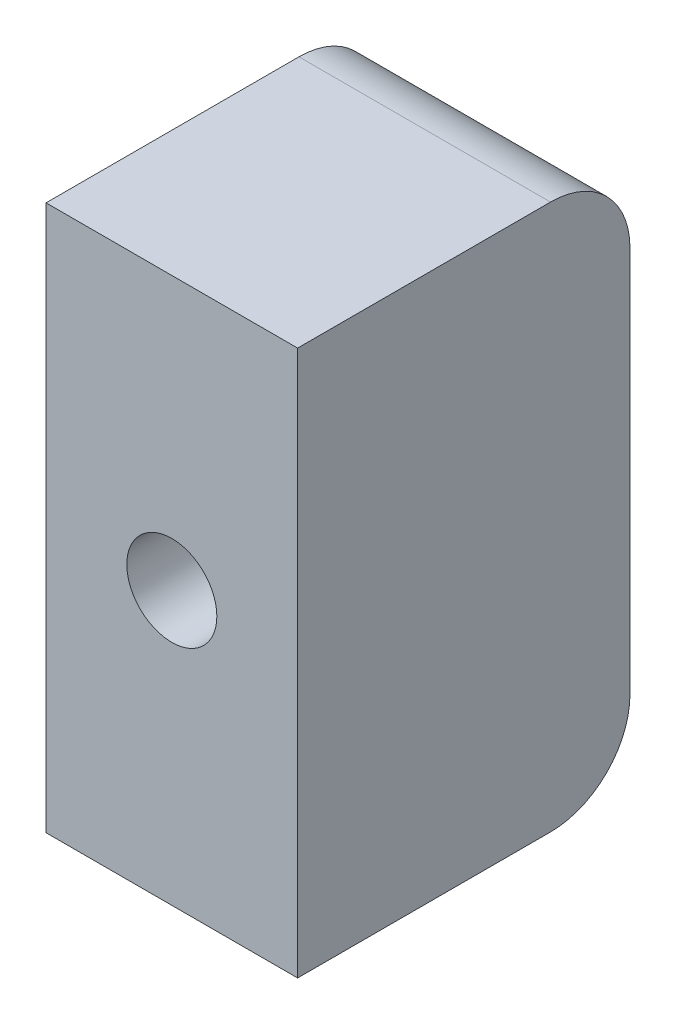
ISO-10303-21;
HEADER;
FILE_DESCRIPTION(('STEP AP214'),'2;1');
FILE_NAME('part.step','',(''),(''),'','','');
FILE_SCHEMA(('AUTOMOTIVE_DESIGN { 1 0 10303 214 1 1 1 1 }'));
ENDSEC;
DATA;
#1=APPLICATION_CONTEXT('core data for automotive mechanical design processes');
#2=APPLICATION_PROTOCOL_DEFINITION('international standard','automotive_design',2000,#1);
#3=PRODUCT_CONTEXT('',#1,'mechanical');
#4=PRODUCT('Part','Part','',(#3));
#5=PRODUCT_RELATED_PRODUCT_CATEGORY('part','',(#4));
#6=PRODUCT_DEFINITION_FORMATION('','',#4);
#7=PRODUCT_DEFINITION_CONTEXT('part definition',#1,'design');
#8=PRODUCT_DEFINITION('design','',#6,#7);
#9=PRODUCT_DEFINITION_SHAPE('','',#8);
#10=(LENGTH_UNIT() NAMED_UNIT(*) SI_UNIT(.MILLI.,.METRE.));
#11=(NAMED_UNIT(*) PLANE_ANGLE_UNIT() SI_UNIT($,.RADIAN.));
#12=(NAMED_UNIT(*) SI_UNIT($,.STERADIAN.) SOLID_ANGLE_UNIT());
#13=UNCERTAINTY_MEASURE_WITH_UNIT(LENGTH_MEASURE(1.E-05),#10,'distance_accuracy_value','');
#14=(GEOMETRIC_REPRESENTATION_CONTEXT(3) GLOBAL_UNCERTAINTY_ASSIGNED_CONTEXT((#13)) GLOBAL_UNIT_ASSIGNED_CONTEXT((#10,
#11,#12)) REPRESENTATION_CONTEXT('',''));
#15=CARTESIAN_POINT('',(0.,0.,0.));
#16=DIRECTION('',(0.,0.,1.));
#17=DIRECTION('',(1.,0.,0.));
#18=AXIS2_PLACEMENT_3D('',#15,#16,#17);
#19=CARTESIAN_POINT('',(-67.2436524322106,15.4000000000002,6.00000000000023));
#20=DIRECTION('',(1.,0.,0.));
#21=DIRECTION('',(0.,0.,-1.));
#22=AXIS2_PLACEMENT_3D('',#19,#20,#21);
#23=CYLINDRICAL_SURFACE('',#22,6.);
#24=CARTESIAN_POINT('',(-18.9999999999994,15.4000000000002,6.00000000000001));
#25=DIRECTION('',(1.,0.,0.));
#26=DIRECTION('',(0.,0.,-1.));
#27=AXIS2_PLACEMENT_3D('',#24,#25,#26);
#28=CIRCLE('',#27,6.);
#29=CARTESIAN_POINT('',(-18.9999999999994,15.4000000000002,0.));
#30=VERTEX_POINT('',#29);
#31=CARTESIAN_POINT('',(-18.9999999999994,9.40000000000017,6.00000000000034));
#32=VERTEX_POINT('',#31);
#33=EDGE_CURVE('E49',#30,#32,#28,.F.);
#34=ORIENTED_EDGE('',*,*,#33,.F.);
#35=DIRECTION('',(1.,0.,0.));
#36=VECTOR('',#35,1.);
#37=CARTESIAN_POINT('',(-67.2436524322106,15.4000000000001,2.22044604925031E-13));
#38=LINE('',#37,#36);
#39=CARTESIAN_POINT('',(0.,15.4000000000001,0.));
#40=VERTEX_POINT('',#39);
#41=EDGE_CURVE('E88',#30,#40,#38,.T.);
#42=ORIENTED_EDGE('',*,*,#41,.T.);
#43=CARTESIAN_POINT('',(0.,15.4000000000001,6.00000000000001));
#44=DIRECTION('',(1.,0.,0.));
#45=DIRECTION('',(0.,0.,-1.));
#46=AXIS2_PLACEMENT_3D('',#43,#44,#45);
#47=CIRCLE('',#46,6.);
#48=CARTESIAN_POINT('',(0.,9.40000000000014,6.00000000000034));
#49=VERTEX_POINT('',#48);
#50=EDGE_CURVE('E92',#49,#40,#47,.T.);
#51=ORIENTED_EDGE('',*,*,#50,.F.);
#52=DIRECTION('',(1.,0.,0.));
#53=VECTOR('',#52,1.);
#54=CARTESIAN_POINT('',(-67.2436524322106,9.40000000000016,6.0000000000005));
#55=LINE('',#54,#53);
#56=EDGE_CURVE('E125',#32,#49,#55,.T.);
#57=ORIENTED_EDGE('',*,*,#56,.F.);
#58=EDGE_LOOP('',(#34,#42,#51,#57));
#59=FACE_BOUND('',#58,.T.);
#60=ADVANCED_FACE('F40',(#59),#23,.T.);
#61=CARTESIAN_POINT('',(-67.2436524322106,9.40000000000016,6.0000000000005));
#62=DIRECTION('',(0.,-0.999999999999999,0.));
#63=DIRECTION('',(0.,0.,-1.));
#64=AXIS2_PLACEMENT_3D('',#61,#62,#63);
#65=PLANE('',#64);
#66=DIRECTION('',(0.,0.,1.));
#67=VECTOR('',#66,1.);
#68=CARTESIAN_POINT('',(-18.9999999999994,9.40000000000017,6.00000000000034));
#69=LINE('',#68,#67);
#70=CARTESIAN_POINT('',(-18.9999999999994,9.40000000000012,25.1000000000002));
#71=VERTEX_POINT('',#70);
#72=EDGE_CURVE('E147',#32,#71,#69,.T.);
#73=ORIENTED_EDGE('',*,*,#72,.F.);
#74=ORIENTED_EDGE('',*,*,#56,.T.);
#75=DIRECTION('',(0.,0.,-1.));
#76=VECTOR('',#75,1.);
#77=CARTESIAN_POINT('',(0.,9.40000000000014,6.00000000000034));
#78=LINE('',#77,#76);
#79=CARTESIAN_POINT('',(0.,9.40000000000007,25.1000000000002));
#80=VERTEX_POINT('',#79);
#81=EDGE_CURVE('E98',#80,#49,#78,.T.);
#82=ORIENTED_EDGE('',*,*,#81,.F.);
#83=DIRECTION('',(1.,0.,0.));
#84=VECTOR('',#83,1.);
#85=CARTESIAN_POINT('',(-67.2436524322106,9.4000000000001,25.1000000000005));
#86=LINE('',#85,#84);
#87=EDGE_CURVE('E128',#71,#80,#86,.T.);
#88=ORIENTED_EDGE('',*,*,#87,.F.);
#89=EDGE_LOOP('',(#73,#74,#82,#88));
#90=FACE_BOUND('',#89,.T.);
#91=ADVANCED_FACE('F146',(#90),#65,.T.);
#92=CARTESIAN_POINT('',(-67.2436524322105,50.6,25.1000000000007));
#93=DIRECTION('',(0.,0.,1.));
#94=DIRECTION('',(1.,0.,0.));
#95=AXIS2_PLACEMENT_3D('',#92,#93,#94);
#96=PLANE('',#95);
#97=CARTESIAN_POINT('',(-9.49999999999951,30.0000000000001,25.1000000000005));
#98=DIRECTION('',(0.,0.,1.));
#99=DIRECTION('',(1.,0.,0.));
#100=AXIS2_PLACEMENT_3D('',#97,#98,#99);
#101=CIRCLE('',#100,3.39999999999999);
#102=CARTESIAN_POINT('',(-6.09999999999952,30.0000000000001,25.1000000000005));
#103=VERTEX_POINT('',#102);
#104=EDGE_CURVE('E43',#103,#103,#101,.T.);
#105=ORIENTED_EDGE('',*,*,#104,.F.);
#106=EDGE_LOOP('',(#105));
#107=FACE_BOUND('',#106,.T.);
#108=DIRECTION('',(0.,0.999999999999999,0.));
#109=VECTOR('',#108,1.);
#110=CARTESIAN_POINT('',(-18.9999999999995,50.6,25.1000000000005));
#111=LINE('',#110,#109);
#112=CARTESIAN_POINT('',(-18.9999999999995,50.6,25.1000000000005));
#113=VERTEX_POINT('',#112);
#114=EDGE_CURVE('E150',#71,#113,#111,.T.);
#115=ORIENTED_EDGE('',*,*,#114,.F.);
#116=ORIENTED_EDGE('',*,*,#87,.T.);
#117=DIRECTION('',(0.,-0.999999999999999,0.));
#118=VECTOR('',#117,1.);
#119=CARTESIAN_POINT('',(0.,50.6,25.1000000000005));
#120=LINE('',#119,#118);
#121=CARTESIAN_POINT('',(0.,50.6,25.1000000000005));
#122=VERTEX_POINT('',#121);
#123=EDGE_CURVE('E122',#122,#80,#120,.T.);
#124=ORIENTED_EDGE('',*,*,#123,.F.);
#125=DIRECTION('',(1.,0.,0.));
#126=VECTOR('',#125,1.);
#127=CARTESIAN_POINT('',(-67.2436524322105,50.6,25.1000000000007));
#128=LINE('',#127,#126);
#129=EDGE_CURVE('E130',#113,#122,#128,.T.);
#130=ORIENTED_EDGE('',*,*,#129,.F.);
#131=EDGE_LOOP('',(#115,#116,#124,#130));
#132=FACE_BOUND('',#131,.T.);
#133=ADVANCED_FACE('F174',(#107,#132),#96,.T.);
#134=CARTESIAN_POINT('',(-67.2436524322105,50.6,25.1000000000007));
#135=DIRECTION('',(0.,0.999999999999999,0.));
#136=DIRECTION('',(0.,0.,1.));
#137=AXIS2_PLACEMENT_3D('',#134,#135,#136);
#138=PLANE('',#137);
#139=DIRECTION('',(0.,0.,-1.));
#140=VECTOR('',#139,1.);
#141=CARTESIAN_POINT('',(-18.9999999999995,50.6,25.1000000000005));
#142=LINE('',#141,#140);
#143=CARTESIAN_POINT('',(-18.9999999999993,50.6000000000002,6.0000000000005));
#144=VERTEX_POINT('',#143);
#145=EDGE_CURVE('E56',#113,#144,#142,.T.);
#146=ORIENTED_EDGE('',*,*,#145,.F.);
#147=ORIENTED_EDGE('',*,*,#129,.T.);
#148=DIRECTION('',(0.,0.,1.));
#149=VECTOR('',#148,1.);
#150=CARTESIAN_POINT('',(0.,50.6,25.1000000000005));
#151=LINE('',#150,#149);
#152=CARTESIAN_POINT('',(0.,50.6000000000001,6.0000000000005));
#153=VERTEX_POINT('',#152);
#154=EDGE_CURVE('E119',#153,#122,#151,.T.);
#155=ORIENTED_EDGE('',*,*,#154,.F.);
#156=DIRECTION('',(1.,0.,0.));
#157=VECTOR('',#156,1.);
#158=CARTESIAN_POINT('',(-67.2436524322105,50.6000000000002,6.00000000000073));
#159=LINE('',#158,#157);
#160=EDGE_CURVE('E132',#144,#153,#159,.T.);
#161=ORIENTED_EDGE('',*,*,#160,.F.);
#162=EDGE_LOOP('',(#146,#147,#155,#161));
#163=FACE_BOUND('',#162,.T.);
#164=ADVANCED_FACE('F139',(#163),#138,.T.);
#165=CARTESIAN_POINT('',(-67.2436524322107,44.6000000000002,6.00000000000023));
#166=DIRECTION('',(1.,0.,0.));
#167=DIRECTION('',(0.,0.,-1.));
#168=AXIS2_PLACEMENT_3D('',#165,#166,#167);
#169=CYLINDRICAL_SURFACE('',#168,6.);
#170=CARTESIAN_POINT('',(-18.9999999999992,44.6000000000002,6.00000000000001));
#171=DIRECTION('',(1.,0.,0.));
#172=DIRECTION('',(0.,0.,-1.));
#173=AXIS2_PLACEMENT_3D('',#170,#171,#172);
#174=CIRCLE('',#173,6.);
#175=CARTESIAN_POINT('',(-18.9999999999994,44.6000000000001,0.));
#176=VERTEX_POINT('',#175);
#177=EDGE_CURVE('E127',#144,#176,#174,.F.);
#178=ORIENTED_EDGE('',*,*,#177,.F.);
#179=ORIENTED_EDGE('',*,*,#160,.T.);
#180=CARTESIAN_POINT('',(2.22044604925031E-13,44.6000000000001,6.00000000000001));
#181=DIRECTION('',(1.,0.,0.));
#182=DIRECTION('',(0.,0.,-1.));
#183=AXIS2_PLACEMENT_3D('',#180,#181,#182);
#184=CIRCLE('',#183,6.);
#185=CARTESIAN_POINT('',(0.,44.6000000000001,0.));
#186=VERTEX_POINT('',#185);
#187=EDGE_CURVE('E107',#186,#153,#184,.T.);
#188=ORIENTED_EDGE('',*,*,#187,.F.);
#189=DIRECTION('',(1.,0.,0.));
#190=VECTOR('',#189,1.);
#191=CARTESIAN_POINT('',(-67.2436524322107,44.6000000000001,2.22044604925031E-13));
#192=LINE('',#191,#190);
#193=EDGE_CURVE('E97',#176,#186,#192,.T.);
#194=ORIENTED_EDGE('',*,*,#193,.F.);
#195=EDGE_LOOP('',(#178,#179,#188,#194));
#196=FACE_BOUND('',#195,.T.);
#197=ADVANCED_FACE('F137',(#196),#169,.T.);
#198=CARTESIAN_POINT('',(-67.2436524322107,44.6000000000001,2.22044604925031E-13));
#199=DIRECTION('',(0.,0.,-1.));
#200=DIRECTION('',(0.,0.999999999999999,0.));
#201=AXIS2_PLACEMENT_3D('',#198,#199,#200);
#202=PLANE('',#201);
#203=CARTESIAN_POINT('',(-9.49999999999973,30.0000000000001,4.9960036108132E-13));
#204=DIRECTION('',(0.,0.,-1.));
#205=DIRECTION('',(0.,0.999999999999999,0.));
#206=AXIS2_PLACEMENT_3D('',#203,#204,#205);
#207=CIRCLE('',#206,4.25);
#208=CARTESIAN_POINT('',(-9.49999999999973,34.2500000000001,5.00114567336383E-13));
#209=VERTEX_POINT('',#208);
#210=EDGE_CURVE('E157',#209,#209,#207,.T.);
#211=ORIENTED_EDGE('',*,*,#210,.F.);
#212=EDGE_LOOP('',(#211));
#213=FACE_BOUND('',#212,.T.);
#214=DIRECTION('',(0.,-0.999999999999999,0.));
#215=VECTOR('',#214,1.);
#216=CARTESIAN_POINT('',(-18.9999999999994,44.6000000000001,0.));
#217=LINE('',#216,#215);
#218=EDGE_CURVE('E11',#176,#30,#217,.T.);
#219=ORIENTED_EDGE('',*,*,#218,.F.);
#220=ORIENTED_EDGE('',*,*,#193,.T.);
#221=DIRECTION('',(0.,0.999999999999999,0.));
#222=VECTOR('',#221,1.);
#223=CARTESIAN_POINT('',(0.,44.6000000000001,0.));
#224=LINE('',#223,#222);
#225=EDGE_CURVE('E101',#40,#186,#224,.T.);
#226=ORIENTED_EDGE('',*,*,#225,.F.);
#227=ORIENTED_EDGE('',*,*,#41,.F.);
#228=EDGE_LOOP('',(#219,#220,#226,#227));
#229=FACE_BOUND('',#228,.T.);
#230=ADVANCED_FACE('F102',(#213,#229),#202,.T.);
#231=CARTESIAN_POINT('',(0.,15.4000000000001,6.00000000000001));
#232=DIRECTION('',(1.,0.,0.));
#233=DIRECTION('',(0.,0.,-1.));
#234=AXIS2_PLACEMENT_3D('',#231,#232,#233);
#235=PLANE('',#234);
#236=ORIENTED_EDGE('',*,*,#50,.T.);
#237=ORIENTED_EDGE('',*,*,#225,.T.);
#238=ORIENTED_EDGE('',*,*,#187,.T.);
#239=ORIENTED_EDGE('',*,*,#154,.T.);
#240=ORIENTED_EDGE('',*,*,#123,.T.);
#241=ORIENTED_EDGE('',*,*,#81,.T.);
#242=EDGE_LOOP('',(#236,#237,#238,#239,#240,#241));
#243=FACE_BOUND('',#242,.T.);
#244=ADVANCED_FACE('F109',(#243),#235,.T.);
#245=CARTESIAN_POINT('',(-18.9999999999995,-42.2499999999998,497.49888501073));
#246=DIRECTION('',(1.,0.,0.));
#247=DIRECTION('',(0.,0.999999999999999,0.));
#248=AXIS2_PLACEMENT_3D('',#245,#246,#247);
#249=PLANE('',#248);
#250=ORIENTED_EDGE('',*,*,#33,.T.);
#251=ORIENTED_EDGE('',*,*,#72,.T.);
#252=ORIENTED_EDGE('',*,*,#114,.T.);
#253=ORIENTED_EDGE('',*,*,#145,.T.);
#254=ORIENTED_EDGE('',*,*,#177,.T.);
#255=ORIENTED_EDGE('',*,*,#218,.T.);
#256=EDGE_LOOP('',(#250,#251,#252,#253,#254,#255));
#257=FACE_BOUND('',#256,.T.);
#258=ADVANCED_FACE('F148',(#257),#249,.F.);
#259=CARTESIAN_POINT('',(-9.49999999999973,30.0000000000001,4.9960036108132E-13));
#260=DIRECTION('',(0.,0.,-1.));
#261=DIRECTION('',(0.,0.999999999999999,0.));
#262=AXIS2_PLACEMENT_3D('',#259,#260,#261);
#263=CYLINDRICAL_SURFACE('',#262,3.39999999999999);
#264=ORIENTED_EDGE('',*,*,#104,.T.);
#265=EDGE_LOOP('',(#264));
#266=FACE_BOUND('',#265,.T.);
#267=CARTESIAN_POINT('',(-9.49999999999973,30.0000000000002,0.850000000000461));
#268=DIRECTION('',(0.,0.,-1.));
#269=DIRECTION('',(0.,0.999999999999999,0.));
#270=AXIS2_PLACEMENT_3D('',#267,#268,#269);
#271=CIRCLE('',#270,3.4);
#272=CARTESIAN_POINT('',(-9.49999999999973,33.4000000000001,0.850000000000462));
#273=VERTEX_POINT('',#272);
#274=EDGE_CURVE('E114',#273,#273,#271,.T.);
#275=ORIENTED_EDGE('',*,*,#274,.T.);
#276=EDGE_LOOP('',(#275));
#277=FACE_BOUND('',#276,.T.);
#278=ADVANCED_FACE('F205',(#266,#277),#263,.F.);
#279=CARTESIAN_POINT('',(-9.49999999999973,30.0000000000001,4.9960036108132E-13));
#280=DIRECTION('',(0.,0.,-1.));
#281=DIRECTION('',(0.,0.999999999999999,0.));
#282=AXIS2_PLACEMENT_3D('',#279,#280,#281);
#283=CONICAL_SURFACE('',#282,4.25,0.785398163397451);
#284=ORIENTED_EDGE('',*,*,#274,.F.);
#285=EDGE_LOOP('',(#284));
#286=FACE_BOUND('',#285,.T.);
#287=ORIENTED_EDGE('',*,*,#210,.T.);
#288=EDGE_LOOP('',(#287));
#289=FACE_BOUND('',#288,.T.);
#290=ADVANCED_FACE('F161',(#286,#289),#283,.F.);
#291=CLOSED_SHELL('',(#60,#91,#133,#164,#197,#230,#244,#258,#278,#290));
#292=MANIFOLD_SOLID_BREP('B2',#291);
#293=ADVANCED_BREP_SHAPE_REPRESENTATION('',(#18,#292),#14);
#294=SHAPE_DEFINITION_REPRESENTATION(#9,#293);
ENDSEC;
END-ISO-10303-21;
